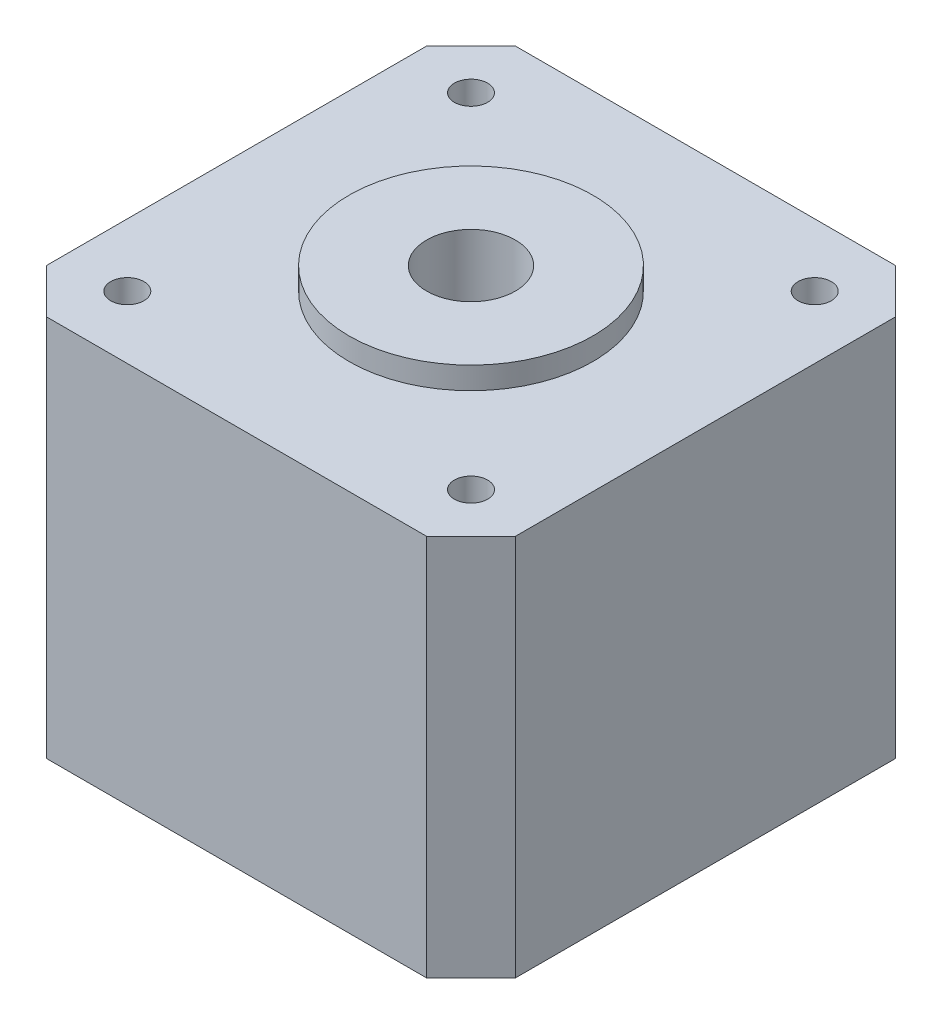
ISO-10303-21;
HEADER;
FILE_DESCRIPTION(('STEP AP214'),'2;1');
FILE_NAME('part.step','',(''),(''),'','','');
FILE_SCHEMA(('AUTOMOTIVE_DESIGN { 1 0 10303 214 1 1 1 1 }'));
ENDSEC;
DATA;
#1=APPLICATION_CONTEXT('core data for automotive mechanical design processes');
#2=APPLICATION_PROTOCOL_DEFINITION('international standard','automotive_design',2000,#1);
#3=PRODUCT_CONTEXT('',#1,'mechanical');
#4=PRODUCT('Part','Part','',(#3));
#5=PRODUCT_RELATED_PRODUCT_CATEGORY('part','',(#4));
#6=PRODUCT_DEFINITION_FORMATION('','',#4);
#7=PRODUCT_DEFINITION_CONTEXT('part definition',#1,'design');
#8=PRODUCT_DEFINITION('design','',#6,#7);
#9=PRODUCT_DEFINITION_SHAPE('','',#8);
#10=(LENGTH_UNIT() NAMED_UNIT(*) SI_UNIT(.MILLI.,.METRE.));
#11=(NAMED_UNIT(*) PLANE_ANGLE_UNIT() SI_UNIT($,.RADIAN.));
#12=(NAMED_UNIT(*) SI_UNIT($,.STERADIAN.) SOLID_ANGLE_UNIT());
#13=UNCERTAINTY_MEASURE_WITH_UNIT(LENGTH_MEASURE(1.E-05),#10,'distance_accuracy_value','');
#14=(GEOMETRIC_REPRESENTATION_CONTEXT(3) GLOBAL_UNCERTAINTY_ASSIGNED_CONTEXT((#13)) GLOBAL_UNIT_ASSIGNED_CONTEXT((#10,
#11,#12)) REPRESENTATION_CONTEXT('',''));
#15=CARTESIAN_POINT('',(0.,0.,0.));
#16=DIRECTION('',(0.,0.,1.));
#17=DIRECTION('',(1.,0.,0.));
#18=AXIS2_PLACEMENT_3D('',#15,#16,#17);
#19=CARTESIAN_POINT('',(21.15,34.5,-21.15));
#20=DIRECTION('',(-1.,0.,0.));
#21=DIRECTION('',(0.,0.,1.));
#22=AXIS2_PLACEMENT_3D('',#19,#20,#21);
#23=PLANE('',#22);
#24=DIRECTION('',(0.,0.,-1.));
#25=VECTOR('',#24,1.);
#26=CARTESIAN_POINT('',(21.15,0.,-21.15));
#27=LINE('',#26,#25);
#28=CARTESIAN_POINT('',(21.15,0.,17.15));
#29=VERTEX_POINT('',#28);
#30=CARTESIAN_POINT('',(21.15,0.,-17.15));
#31=VERTEX_POINT('',#30);
#32=EDGE_CURVE('E136',#29,#31,#27,.T.);
#33=ORIENTED_EDGE('',*,*,#32,.T.);
#34=DIRECTION('',(0.,1.,0.));
#35=VECTOR('',#34,1.);
#36=CARTESIAN_POINT('',(21.15,34.5,-17.15));
#37=LINE('',#36,#35);
#38=CARTESIAN_POINT('',(21.15,34.5,-17.15));
#39=VERTEX_POINT('',#38);
#40=EDGE_CURVE('E114',#31,#39,#37,.T.);
#41=ORIENTED_EDGE('',*,*,#40,.T.);
#42=DIRECTION('',(0.,0.,-1.));
#43=VECTOR('',#42,1.);
#44=CARTESIAN_POINT('',(21.15,34.5,-21.15));
#45=LINE('',#44,#43);
#46=CARTESIAN_POINT('',(21.15,34.5,17.15));
#47=VERTEX_POINT('',#46);
#48=EDGE_CURVE('E146',#47,#39,#45,.T.);
#49=ORIENTED_EDGE('',*,*,#48,.F.);
#50=DIRECTION('',(0.,-1.,0.));
#51=VECTOR('',#50,1.);
#52=CARTESIAN_POINT('',(21.15,34.5,17.15));
#53=LINE('',#52,#51);
#54=EDGE_CURVE('E119',#47,#29,#53,.T.);
#55=ORIENTED_EDGE('',*,*,#54,.T.);
#56=EDGE_LOOP('',(#33,#41,#49,#55));
#57=FACE_BOUND('',#56,.T.);
#58=ADVANCED_FACE('F42',(#57),#23,.F.);
#59=CARTESIAN_POINT('',(-21.15,34.5,-21.15));
#60=DIRECTION('',(0.,0.,1.));
#61=DIRECTION('',(1.,0.,0.));
#62=AXIS2_PLACEMENT_3D('',#59,#60,#61);
#63=PLANE('',#62);
#64=DIRECTION('',(-1.,0.,0.));
#65=VECTOR('',#64,1.);
#66=CARTESIAN_POINT('',(-21.15,34.5,-21.15));
#67=LINE('',#66,#65);
#68=CARTESIAN_POINT('',(17.15,34.5,-21.15));
#69=VERTEX_POINT('',#68);
#70=CARTESIAN_POINT('',(-17.15,34.5,-21.15));
#71=VERTEX_POINT('',#70);
#72=EDGE_CURVE('E129',#69,#71,#67,.T.);
#73=ORIENTED_EDGE('',*,*,#72,.F.);
#74=DIRECTION('',(0.,-1.,0.));
#75=VECTOR('',#74,1.);
#76=CARTESIAN_POINT('',(17.15,34.5,-21.15));
#77=LINE('',#76,#75);
#78=CARTESIAN_POINT('',(17.15,0.,-21.15));
#79=VERTEX_POINT('',#78);
#80=EDGE_CURVE('E113',#69,#79,#77,.T.);
#81=ORIENTED_EDGE('',*,*,#80,.T.);
#82=DIRECTION('',(-1.,0.,0.));
#83=VECTOR('',#82,1.);
#84=CARTESIAN_POINT('',(-21.15,0.,-21.15));
#85=LINE('',#84,#83);
#86=CARTESIAN_POINT('',(-17.15,0.,-21.15));
#87=VERTEX_POINT('',#86);
#88=EDGE_CURVE('E126',#79,#87,#85,.T.);
#89=ORIENTED_EDGE('',*,*,#88,.T.);
#90=DIRECTION('',(0.,1.,0.));
#91=VECTOR('',#90,1.);
#92=CARTESIAN_POINT('',(-17.15,34.5,-21.15));
#93=LINE('',#92,#91);
#94=EDGE_CURVE('E131',#87,#71,#93,.T.);
#95=ORIENTED_EDGE('',*,*,#94,.T.);
#96=EDGE_LOOP('',(#73,#81,#89,#95));
#97=FACE_BOUND('',#96,.T.);
#98=ADVANCED_FACE('F125',(#97),#63,.F.);
#99=CARTESIAN_POINT('',(-21.15,34.5,-21.15));
#100=DIRECTION('',(1.,0.,0.));
#101=DIRECTION('',(0.,0.,-1.));
#102=AXIS2_PLACEMENT_3D('',#99,#100,#101);
#103=PLANE('',#102);
#104=DIRECTION('',(0.,0.,1.));
#105=VECTOR('',#104,1.);
#106=CARTESIAN_POINT('',(-21.15,0.,-21.15));
#107=LINE('',#106,#105);
#108=CARTESIAN_POINT('',(-21.15,0.,-17.15));
#109=VERTEX_POINT('',#108);
#110=CARTESIAN_POINT('',(-21.15,0.,17.15));
#111=VERTEX_POINT('',#110);
#112=EDGE_CURVE('E135',#109,#111,#107,.T.);
#113=ORIENTED_EDGE('',*,*,#112,.T.);
#114=DIRECTION('',(0.,1.,0.));
#115=VECTOR('',#114,1.);
#116=CARTESIAN_POINT('',(-21.15,34.5,17.15));
#117=LINE('',#116,#115);
#118=CARTESIAN_POINT('',(-21.15,34.5,17.15));
#119=VERTEX_POINT('',#118);
#120=EDGE_CURVE('E11',#111,#119,#117,.T.);
#121=ORIENTED_EDGE('',*,*,#120,.T.);
#122=DIRECTION('',(0.,0.,1.));
#123=VECTOR('',#122,1.);
#124=CARTESIAN_POINT('',(-21.15,34.5,-21.15));
#125=LINE('',#124,#123);
#126=CARTESIAN_POINT('',(-21.15,34.5,-17.15));
#127=VERTEX_POINT('',#126);
#128=EDGE_CURVE('E172',#127,#119,#125,.T.);
#129=ORIENTED_EDGE('',*,*,#128,.F.);
#130=DIRECTION('',(0.,-1.,0.));
#131=VECTOR('',#130,1.);
#132=CARTESIAN_POINT('',(-21.15,34.5,-17.15));
#133=LINE('',#132,#131);
#134=EDGE_CURVE('E51',#127,#109,#133,.T.);
#135=ORIENTED_EDGE('',*,*,#134,.T.);
#136=EDGE_LOOP('',(#113,#121,#129,#135));
#137=FACE_BOUND('',#136,.T.);
#138=ADVANCED_FACE('F170',(#137),#103,.F.);
#139=CARTESIAN_POINT('',(-21.15,34.5,21.15));
#140=DIRECTION('',(0.,0.,-1.));
#141=DIRECTION('',(-1.,0.,0.));
#142=AXIS2_PLACEMENT_3D('',#139,#140,#141);
#143=PLANE('',#142);
#144=DIRECTION('',(1.,0.,0.));
#145=VECTOR('',#144,1.);
#146=CARTESIAN_POINT('',(-21.15,0.,21.15));
#147=LINE('',#146,#145);
#148=CARTESIAN_POINT('',(-17.15,0.,21.15));
#149=VERTEX_POINT('',#148);
#150=CARTESIAN_POINT('',(17.15,0.,21.15));
#151=VERTEX_POINT('',#150);
#152=EDGE_CURVE('E139',#149,#151,#147,.T.);
#153=ORIENTED_EDGE('',*,*,#152,.T.);
#154=DIRECTION('',(0.,1.,0.));
#155=VECTOR('',#154,1.);
#156=CARTESIAN_POINT('',(17.15,34.5,21.15));
#157=LINE('',#156,#155);
#158=CARTESIAN_POINT('',(17.15,34.5,21.15));
#159=VERTEX_POINT('',#158);
#160=EDGE_CURVE('E58',#151,#159,#157,.T.);
#161=ORIENTED_EDGE('',*,*,#160,.T.);
#162=DIRECTION('',(1.,0.,0.));
#163=VECTOR('',#162,1.);
#164=CARTESIAN_POINT('',(-21.15,34.5,21.15));
#165=LINE('',#164,#163);
#166=CARTESIAN_POINT('',(-17.15,34.5,21.15));
#167=VERTEX_POINT('',#166);
#168=EDGE_CURVE('E180',#167,#159,#165,.T.);
#169=ORIENTED_EDGE('',*,*,#168,.F.);
#170=DIRECTION('',(0.,-1.,0.));
#171=VECTOR('',#170,1.);
#172=CARTESIAN_POINT('',(-17.15,34.5,21.15));
#173=LINE('',#172,#171);
#174=EDGE_CURVE('E163',#167,#149,#173,.T.);
#175=ORIENTED_EDGE('',*,*,#174,.T.);
#176=EDGE_LOOP('',(#153,#161,#169,#175));
#177=FACE_BOUND('',#176,.T.);
#178=ADVANCED_FACE('F179',(#177),#143,.F.);
#179=CARTESIAN_POINT('',(0.,34.5,0.));
#180=DIRECTION('',(0.,1.,0.));
#181=DIRECTION('',(0.,0.,1.));
#182=AXIS2_PLACEMENT_3D('',#179,#180,#181);
#183=PLANE('',#182);
#184=CARTESIAN_POINT('',(-15.5,34.5,15.5));
#185=DIRECTION('',(0.,1.,0.));
#186=DIRECTION('',(0.,0.,-1.));
#187=AXIS2_PLACEMENT_3D('',#184,#185,#186);
#188=CIRCLE('',#187,1.5);
#189=CARTESIAN_POINT('',(-15.5,34.5,14.));
#190=VERTEX_POINT('',#189);
#191=EDGE_CURVE('E198',#190,#190,#188,.T.);
#192=ORIENTED_EDGE('',*,*,#191,.F.);
#193=EDGE_LOOP('',(#192));
#194=FACE_BOUND('',#193,.T.);
#195=CARTESIAN_POINT('',(15.5,34.5,15.5));
#196=DIRECTION('',(0.,1.,0.));
#197=DIRECTION('',(0.,0.,1.));
#198=AXIS2_PLACEMENT_3D('',#195,#196,#197);
#199=CIRCLE('',#198,1.5);
#200=CARTESIAN_POINT('',(15.5,34.5,17.));
#201=VERTEX_POINT('',#200);
#202=EDGE_CURVE('E205',#201,#201,#199,.T.);
#203=ORIENTED_EDGE('',*,*,#202,.F.);
#204=EDGE_LOOP('',(#203));
#205=FACE_BOUND('',#204,.T.);
#206=CARTESIAN_POINT('',(15.5,34.5,-15.5));
#207=DIRECTION('',(0.,1.,0.));
#208=DIRECTION('',(0.,0.,-1.));
#209=AXIS2_PLACEMENT_3D('',#206,#207,#208);
#210=CIRCLE('',#209,1.5);
#211=CARTESIAN_POINT('',(15.5,34.5,-17.));
#212=VERTEX_POINT('',#211);
#213=EDGE_CURVE('E211',#212,#212,#210,.T.);
#214=ORIENTED_EDGE('',*,*,#213,.F.);
#215=EDGE_LOOP('',(#214));
#216=FACE_BOUND('',#215,.T.);
#217=CARTESIAN_POINT('',(-15.5,34.5,-15.5));
#218=DIRECTION('',(0.,1.,0.));
#219=DIRECTION('',(0.,0.,1.));
#220=AXIS2_PLACEMENT_3D('',#217,#218,#219);
#221=CIRCLE('',#220,1.5);
#222=CARTESIAN_POINT('',(-15.5,34.5,-14.));
#223=VERTEX_POINT('',#222);
#224=EDGE_CURVE('E192',#223,#223,#221,.T.);
#225=ORIENTED_EDGE('',*,*,#224,.F.);
#226=EDGE_LOOP('',(#225));
#227=FACE_BOUND('',#226,.T.);
#228=CARTESIAN_POINT('',(0.,34.5,0.));
#229=DIRECTION('',(0.,1.,0.));
#230=DIRECTION('',(0.,0.,1.));
#231=AXIS2_PLACEMENT_3D('',#228,#229,#230);
#232=CIRCLE('',#231,11.);
#233=CARTESIAN_POINT('',(0.,34.5,11.));
#234=VERTEX_POINT('',#233);
#235=EDGE_CURVE('E147',#234,#234,#232,.T.);
#236=ORIENTED_EDGE('',*,*,#235,.F.);
#237=EDGE_LOOP('',(#236));
#238=FACE_BOUND('',#237,.T.);
#239=ORIENTED_EDGE('',*,*,#48,.T.);
#240=DIRECTION('',(0.707106781186547,0.,0.707106781186548));
#241=VECTOR('',#240,1.);
#242=CARTESIAN_POINT('',(19.15,34.5,-19.15));
#243=LINE('',#242,#241);
#244=EDGE_CURVE('E161',#39,#69,#243,.F.);
#245=ORIENTED_EDGE('',*,*,#244,.T.);
#246=ORIENTED_EDGE('',*,*,#72,.T.);
#247=DIRECTION('',(0.707106781186548,0.,-0.707106781186547));
#248=VECTOR('',#247,1.);
#249=CARTESIAN_POINT('',(-19.15,34.5,-19.15));
#250=LINE('',#249,#248);
#251=EDGE_CURVE('E156',#71,#127,#250,.F.);
#252=ORIENTED_EDGE('',*,*,#251,.T.);
#253=ORIENTED_EDGE('',*,*,#128,.T.);
#254=DIRECTION('',(-0.707106781186546,0.,-0.707106781186549));
#255=VECTOR('',#254,1.);
#256=CARTESIAN_POINT('',(-19.15,34.5,19.1499999999999));
#257=LINE('',#256,#255);
#258=EDGE_CURVE('E65',#119,#167,#257,.F.);
#259=ORIENTED_EDGE('',*,*,#258,.T.);
#260=ORIENTED_EDGE('',*,*,#168,.T.);
#261=DIRECTION('',(-0.707106781186549,0.,0.707106781186546));
#262=VECTOR('',#261,1.);
#263=CARTESIAN_POINT('',(19.15,34.5,19.15));
#264=LINE('',#263,#262);
#265=EDGE_CURVE('E159',#159,#47,#264,.F.);
#266=ORIENTED_EDGE('',*,*,#265,.T.);
#267=EDGE_LOOP('',(#239,#245,#246,#252,#253,#259,#260,#266));
#268=FACE_BOUND('',#267,.T.);
#269=ADVANCED_FACE('F243',(#194,#205,#216,#227,#238,#268),#183,.T.);
#270=CARTESIAN_POINT('',(0.,0.,0.));
#271=DIRECTION('',(0.,1.,0.));
#272=DIRECTION('',(0.,0.,1.));
#273=AXIS2_PLACEMENT_3D('',#270,#271,#272);
#274=PLANE('',#273);
#275=CARTESIAN_POINT('',(0.,0.,0.));
#276=DIRECTION('',(0.,1.,0.));
#277=DIRECTION('',(0.,0.,1.));
#278=AXIS2_PLACEMENT_3D('',#275,#276,#277);
#279=CIRCLE('',#278,4.);
#280=CARTESIAN_POINT('',(0.,0.,4.));
#281=VERTEX_POINT('',#280);
#282=EDGE_CURVE('E202',#281,#281,#279,.T.);
#283=ORIENTED_EDGE('',*,*,#282,.T.);
#284=EDGE_LOOP('',(#283));
#285=FACE_BOUND('',#284,.T.);
#286=ORIENTED_EDGE('',*,*,#88,.F.);
#287=DIRECTION('',(-0.707106781186547,0.,-0.707106781186548));
#288=VECTOR('',#287,1.);
#289=CARTESIAN_POINT('',(17.15,0.,-21.15));
#290=LINE('',#289,#288);
#291=EDGE_CURVE('E109',#79,#31,#290,.F.);
#292=ORIENTED_EDGE('',*,*,#291,.T.);
#293=ORIENTED_EDGE('',*,*,#32,.F.);
#294=DIRECTION('',(0.707106781186549,0.,-0.707106781186546));
#295=VECTOR('',#294,1.);
#296=CARTESIAN_POINT('',(21.15,0.,17.15));
#297=LINE('',#296,#295);
#298=EDGE_CURVE('E120',#29,#151,#297,.F.);
#299=ORIENTED_EDGE('',*,*,#298,.T.);
#300=ORIENTED_EDGE('',*,*,#152,.F.);
#301=DIRECTION('',(0.707106781186546,0.,0.707106781186549));
#302=VECTOR('',#301,1.);
#303=CARTESIAN_POINT('',(-17.15,0.,21.15));
#304=LINE('',#303,#302);
#305=EDGE_CURVE('E150',#149,#111,#304,.F.);
#306=ORIENTED_EDGE('',*,*,#305,.T.);
#307=ORIENTED_EDGE('',*,*,#112,.F.);
#308=DIRECTION('',(-0.707106781186548,0.,0.707106781186547));
#309=VECTOR('',#308,1.);
#310=CARTESIAN_POINT('',(-21.15,0.,-17.15));
#311=LINE('',#310,#309);
#312=EDGE_CURVE('E130',#109,#87,#311,.F.);
#313=ORIENTED_EDGE('',*,*,#312,.T.);
#314=EDGE_LOOP('',(#286,#292,#293,#299,#300,#306,#307,#313));
#315=FACE_BOUND('',#314,.T.);
#316=ADVANCED_FACE('F133',(#285,#315),#274,.F.);
#317=CARTESIAN_POINT('',(0.,36.5,0.));
#318=DIRECTION('',(0.,-1.,0.));
#319=DIRECTION('',(0.,0.,-1.));
#320=AXIS2_PLACEMENT_3D('',#317,#318,#319);
#321=CYLINDRICAL_SURFACE('',#320,11.);
#322=CARTESIAN_POINT('',(0.,36.5,0.));
#323=DIRECTION('',(0.,1.,0.));
#324=DIRECTION('',(0.,0.,1.));
#325=AXIS2_PLACEMENT_3D('',#322,#323,#324);
#326=CIRCLE('',#325,11.);
#327=CARTESIAN_POINT('',(0.,36.5,11.));
#328=VERTEX_POINT('',#327);
#329=EDGE_CURVE('E141',#328,#328,#326,.T.);
#330=ORIENTED_EDGE('',*,*,#329,.F.);
#331=EDGE_LOOP('',(#330));
#332=FACE_BOUND('',#331,.T.);
#333=ORIENTED_EDGE('',*,*,#235,.T.);
#334=EDGE_LOOP('',(#333));
#335=FACE_BOUND('',#334,.T.);
#336=ADVANCED_FACE('F234',(#332,#335),#321,.T.);
#337=CARTESIAN_POINT('',(0.,36.5,0.));
#338=DIRECTION('',(0.,1.,0.));
#339=DIRECTION('',(0.,0.,1.));
#340=AXIS2_PLACEMENT_3D('',#337,#338,#339);
#341=PLANE('',#340);
#342=CARTESIAN_POINT('',(0.,36.5,0.));
#343=DIRECTION('',(0.,1.,0.));
#344=DIRECTION('',(0.,0.,1.));
#345=AXIS2_PLACEMENT_3D('',#342,#343,#344);
#346=CIRCLE('',#345,4.);
#347=CARTESIAN_POINT('',(0.,36.5,4.));
#348=VERTEX_POINT('',#347);
#349=EDGE_CURVE('E216',#348,#348,#346,.T.);
#350=ORIENTED_EDGE('',*,*,#349,.F.);
#351=EDGE_LOOP('',(#350));
#352=FACE_BOUND('',#351,.T.);
#353=ORIENTED_EDGE('',*,*,#329,.T.);
#354=EDGE_LOOP('',(#353));
#355=FACE_BOUND('',#354,.T.);
#356=ADVANCED_FACE('F230',(#352,#355),#341,.T.);
#357=CARTESIAN_POINT('',(-15.5,29.5,-15.5));
#358=DIRECTION('',(0.,1.,0.));
#359=DIRECTION('',(0.,0.,1.));
#360=AXIS2_PLACEMENT_3D('',#357,#358,#359);
#361=CYLINDRICAL_SURFACE('',#360,1.5);
#362=CARTESIAN_POINT('',(-15.5,29.5,-15.5));
#363=DIRECTION('',(0.,1.,0.));
#364=DIRECTION('',(0.,0.,1.));
#365=AXIS2_PLACEMENT_3D('',#362,#363,#364);
#366=CIRCLE('',#365,1.5);
#367=CARTESIAN_POINT('',(-15.5,29.5,-14.));
#368=VERTEX_POINT('',#367);
#369=EDGE_CURVE('E191',#368,#368,#366,.T.);
#370=ORIENTED_EDGE('',*,*,#369,.F.);
#371=EDGE_LOOP('',(#370));
#372=FACE_BOUND('',#371,.T.);
#373=ORIENTED_EDGE('',*,*,#224,.T.);
#374=EDGE_LOOP('',(#373));
#375=FACE_BOUND('',#374,.T.);
#376=ADVANCED_FACE('F233',(#372,#375),#361,.F.);
#377=CARTESIAN_POINT('',(-15.5,29.5,-15.5));
#378=DIRECTION('',(0.,1.,0.));
#379=DIRECTION('',(0.,0.,1.));
#380=AXIS2_PLACEMENT_3D('',#377,#378,#379);
#381=PLANE('',#380);
#382=ORIENTED_EDGE('',*,*,#369,.T.);
#383=EDGE_LOOP('',(#382));
#384=FACE_BOUND('',#383,.T.);
#385=ADVANCED_FACE('F285',(#384),#381,.T.);
#386=CARTESIAN_POINT('',(15.5,29.5,-15.5));
#387=DIRECTION('',(0.,1.,0.));
#388=DIRECTION('',(0.,0.,1.));
#389=AXIS2_PLACEMENT_3D('',#386,#387,#388);
#390=CYLINDRICAL_SURFACE('',#389,1.5);
#391=CARTESIAN_POINT('',(15.5,29.5,-15.5));
#392=DIRECTION('',(0.,1.,0.));
#393=DIRECTION('',(0.,0.,-1.));
#394=AXIS2_PLACEMENT_3D('',#391,#392,#393);
#395=CIRCLE('',#394,1.5);
#396=CARTESIAN_POINT('',(15.5,29.5,-17.));
#397=VERTEX_POINT('',#396);
#398=EDGE_CURVE('E195',#397,#397,#395,.T.);
#399=ORIENTED_EDGE('',*,*,#398,.F.);
#400=EDGE_LOOP('',(#399));
#401=FACE_BOUND('',#400,.T.);
#402=ORIENTED_EDGE('',*,*,#213,.T.);
#403=EDGE_LOOP('',(#402));
#404=FACE_BOUND('',#403,.T.);
#405=ADVANCED_FACE('F289',(#401,#404),#390,.F.);
#406=CARTESIAN_POINT('',(15.5,29.5,-15.5));
#407=DIRECTION('',(0.,-1.,0.));
#408=DIRECTION('',(0.,0.,-1.));
#409=AXIS2_PLACEMENT_3D('',#406,#407,#408);
#410=PLANE('',#409);
#411=ORIENTED_EDGE('',*,*,#398,.T.);
#412=EDGE_LOOP('',(#411));
#413=FACE_BOUND('',#412,.T.);
#414=ADVANCED_FACE('F302',(#413),#410,.F.);
#415=CARTESIAN_POINT('',(15.5,29.5,15.5));
#416=DIRECTION('',(0.,1.,0.));
#417=DIRECTION('',(0.,0.,1.));
#418=AXIS2_PLACEMENT_3D('',#415,#416,#417);
#419=CYLINDRICAL_SURFACE('',#418,1.5);
#420=CARTESIAN_POINT('',(15.5,29.5,15.5));
#421=DIRECTION('',(0.,1.,0.));
#422=DIRECTION('',(0.,0.,1.));
#423=AXIS2_PLACEMENT_3D('',#420,#421,#422);
#424=CIRCLE('',#423,1.5);
#425=CARTESIAN_POINT('',(15.5,29.5,17.));
#426=VERTEX_POINT('',#425);
#427=EDGE_CURVE('E208',#426,#426,#424,.T.);
#428=ORIENTED_EDGE('',*,*,#427,.F.);
#429=EDGE_LOOP('',(#428));
#430=FACE_BOUND('',#429,.T.);
#431=ORIENTED_EDGE('',*,*,#202,.T.);
#432=EDGE_LOOP('',(#431));
#433=FACE_BOUND('',#432,.T.);
#434=ADVANCED_FACE('F299',(#430,#433),#419,.F.);
#435=CARTESIAN_POINT('',(15.5,29.5,15.5));
#436=DIRECTION('',(0.,1.,0.));
#437=DIRECTION('',(0.,0.,1.));
#438=AXIS2_PLACEMENT_3D('',#435,#436,#437);
#439=PLANE('',#438);
#440=ORIENTED_EDGE('',*,*,#427,.T.);
#441=EDGE_LOOP('',(#440));
#442=FACE_BOUND('',#441,.T.);
#443=ADVANCED_FACE('F294',(#442),#439,.T.);
#444=CARTESIAN_POINT('',(-15.5,29.5,15.5));
#445=DIRECTION('',(0.,1.,0.));
#446=DIRECTION('',(0.,0.,1.));
#447=AXIS2_PLACEMENT_3D('',#444,#445,#446);
#448=CYLINDRICAL_SURFACE('',#447,1.5);
#449=CARTESIAN_POINT('',(-15.5,29.5,15.5));
#450=DIRECTION('',(0.,1.,0.));
#451=DIRECTION('',(0.,0.,-1.));
#452=AXIS2_PLACEMENT_3D('',#449,#450,#451);
#453=CIRCLE('',#452,1.5);
#454=CARTESIAN_POINT('',(-15.5,29.5,14.));
#455=VERTEX_POINT('',#454);
#456=EDGE_CURVE('E201',#455,#455,#453,.T.);
#457=ORIENTED_EDGE('',*,*,#456,.F.);
#458=EDGE_LOOP('',(#457));
#459=FACE_BOUND('',#458,.T.);
#460=ORIENTED_EDGE('',*,*,#191,.T.);
#461=EDGE_LOOP('',(#460));
#462=FACE_BOUND('',#461,.T.);
#463=ADVANCED_FACE('F291',(#459,#462),#448,.F.);
#464=CARTESIAN_POINT('',(-15.5,29.5,15.5));
#465=DIRECTION('',(0.,-1.,0.));
#466=DIRECTION('',(0.,0.,-1.));
#467=AXIS2_PLACEMENT_3D('',#464,#465,#466);
#468=PLANE('',#467);
#469=ORIENTED_EDGE('',*,*,#456,.T.);
#470=EDGE_LOOP('',(#469));
#471=FACE_BOUND('',#470,.T.);
#472=ADVANCED_FACE('F226',(#471),#468,.F.);
#473=CARTESIAN_POINT('',(0.,0.,0.));
#474=DIRECTION('',(0.,1.,0.));
#475=DIRECTION('',(0.,0.,1.));
#476=AXIS2_PLACEMENT_3D('',#473,#474,#475);
#477=CYLINDRICAL_SURFACE('',#476,4.);
#478=ORIENTED_EDGE('',*,*,#282,.F.);
#479=EDGE_LOOP('',(#478));
#480=FACE_BOUND('',#479,.T.);
#481=ORIENTED_EDGE('',*,*,#349,.T.);
#482=EDGE_LOOP('',(#481));
#483=FACE_BOUND('',#482,.T.);
#484=ADVANCED_FACE('F223',(#480,#483),#477,.F.);
#485=CARTESIAN_POINT('',(17.15,34.5,-21.15));
#486=DIRECTION('',(-0.707106781186548,0.,0.707106781186547));
#487=DIRECTION('',(0.,-1.,0.));
#488=AXIS2_PLACEMENT_3D('',#485,#486,#487);
#489=PLANE('',#488);
#490=ORIENTED_EDGE('',*,*,#244,.F.);
#491=ORIENTED_EDGE('',*,*,#40,.F.);
#492=ORIENTED_EDGE('',*,*,#291,.F.);
#493=ORIENTED_EDGE('',*,*,#80,.F.);
#494=EDGE_LOOP('',(#490,#491,#492,#493));
#495=FACE_BOUND('',#494,.T.);
#496=ADVANCED_FACE('F112',(#495),#489,.F.);
#497=CARTESIAN_POINT('',(21.15,34.5,17.15));
#498=DIRECTION('',(-0.707106781186546,0.,-0.707106781186549));
#499=DIRECTION('',(0.,-1.,0.));
#500=AXIS2_PLACEMENT_3D('',#497,#498,#499);
#501=PLANE('',#500);
#502=ORIENTED_EDGE('',*,*,#265,.F.);
#503=ORIENTED_EDGE('',*,*,#160,.F.);
#504=ORIENTED_EDGE('',*,*,#298,.F.);
#505=ORIENTED_EDGE('',*,*,#54,.F.);
#506=EDGE_LOOP('',(#502,#503,#504,#505));
#507=FACE_BOUND('',#506,.T.);
#508=ADVANCED_FACE('F251',(#507),#501,.F.);
#509=CARTESIAN_POINT('',(-17.15,34.5,21.15));
#510=DIRECTION('',(0.707106781186549,0.,-0.707106781186546));
#511=DIRECTION('',(0.,-1.,0.));
#512=AXIS2_PLACEMENT_3D('',#509,#510,#511);
#513=PLANE('',#512);
#514=ORIENTED_EDGE('',*,*,#258,.F.);
#515=ORIENTED_EDGE('',*,*,#120,.F.);
#516=ORIENTED_EDGE('',*,*,#305,.F.);
#517=ORIENTED_EDGE('',*,*,#174,.F.);
#518=EDGE_LOOP('',(#514,#515,#516,#517));
#519=FACE_BOUND('',#518,.T.);
#520=ADVANCED_FACE('F178',(#519),#513,.F.);
#521=CARTESIAN_POINT('',(-21.15,34.5,-17.15));
#522=DIRECTION('',(0.707106781186547,0.,0.707106781186548));
#523=DIRECTION('',(0.,-1.,0.));
#524=AXIS2_PLACEMENT_3D('',#521,#522,#523);
#525=PLANE('',#524);
#526=ORIENTED_EDGE('',*,*,#251,.F.);
#527=ORIENTED_EDGE('',*,*,#94,.F.);
#528=ORIENTED_EDGE('',*,*,#312,.F.);
#529=ORIENTED_EDGE('',*,*,#134,.F.);
#530=EDGE_LOOP('',(#526,#527,#528,#529));
#531=FACE_BOUND('',#530,.T.);
#532=ADVANCED_FACE('F45',(#531),#525,.F.);
#533=CLOSED_SHELL('',(#58,#98,#138,#178,#269,#316,#336,#356,#376,#385,#405,#414,#434,#443,#463,
#472,#484,#496,#508,#520,#532));
#534=MANIFOLD_SOLID_BREP('B2',#533);
#535=ADVANCED_BREP_SHAPE_REPRESENTATION('',(#18,#534),#14);
#536=SHAPE_DEFINITION_REPRESENTATION(#9,#535);
ENDSEC;
END-ISO-10303-21;
